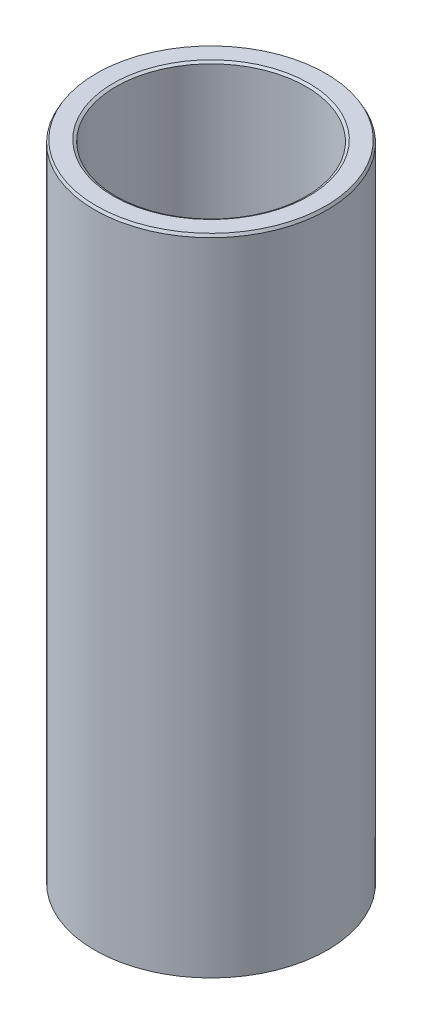
ISO-10303-21;
HEADER;
FILE_DESCRIPTION(('STEP AP214'),'2;1');
FILE_NAME('part.step','',(''),(''),'','','');
FILE_SCHEMA(('AUTOMOTIVE_DESIGN { 1 0 10303 214 1 1 1 1 }'));
ENDSEC;
DATA;
#1=APPLICATION_CONTEXT('core data for automotive mechanical design processes');
#2=APPLICATION_PROTOCOL_DEFINITION('international standard','automotive_design',2000,#1);
#3=PRODUCT_CONTEXT('',#1,'mechanical');
#4=PRODUCT('Part','Part','',(#3));
#5=PRODUCT_RELATED_PRODUCT_CATEGORY('part','',(#4));
#6=PRODUCT_DEFINITION_FORMATION('','',#4);
#7=PRODUCT_DEFINITION_CONTEXT('part definition',#1,'design');
#8=PRODUCT_DEFINITION('design','',#6,#7);
#9=PRODUCT_DEFINITION_SHAPE('','',#8);
#10=(LENGTH_UNIT() NAMED_UNIT(*) SI_UNIT(.MILLI.,.METRE.));
#11=(NAMED_UNIT(*) PLANE_ANGLE_UNIT() SI_UNIT($,.RADIAN.));
#12=(NAMED_UNIT(*) SI_UNIT($,.STERADIAN.) SOLID_ANGLE_UNIT());
#13=UNCERTAINTY_MEASURE_WITH_UNIT(LENGTH_MEASURE(1.E-05),#10,'distance_accuracy_value','');
#14=(GEOMETRIC_REPRESENTATION_CONTEXT(3) GLOBAL_UNCERTAINTY_ASSIGNED_CONTEXT((#13)) GLOBAL_UNIT_ASSIGNED_CONTEXT((#10,
#11,#12)) REPRESENTATION_CONTEXT('',''));
#15=CARTESIAN_POINT('',(0.,0.,0.));
#16=DIRECTION('',(0.,0.,1.));
#17=DIRECTION('',(1.,0.,0.));
#18=AXIS2_PLACEMENT_3D('',#15,#16,#17);
#19=CARTESIAN_POINT('',(0.,291.273279310651,0.));
#20=DIRECTION('',(0.,-1.,0.));
#21=DIRECTION('',(0.,0.,-1.));
#22=AXIS2_PLACEMENT_3D('',#19,#20,#21);
#23=CYLINDRICAL_SURFACE('',#22,52.5);
#24=CARTESIAN_POINT('',(0.,0.705340359352713,0.));
#25=DIRECTION('',(0.,1.,0.));
#26=DIRECTION('',(0.,0.,1.));
#27=AXIS2_PLACEMENT_3D('',#24,#25,#26);
#28=CIRCLE('',#27,52.5);
#29=CARTESIAN_POINT('',(0.,0.705340359352713,52.5));
#30=VERTEX_POINT('',#29);
#31=EDGE_CURVE('E10',#30,#30,#28,.T.);
#32=ORIENTED_EDGE('',*,*,#31,.T.);
#33=EDGE_LOOP('',(#32));
#34=FACE_BOUND('',#33,.T.);
#35=CARTESIAN_POINT('',(0.,290.051593971623,0.));
#36=DIRECTION('',(0.,1.,0.));
#37=DIRECTION('',(0.,0.,1.));
#38=AXIS2_PLACEMENT_3D('',#35,#36,#37);
#39=CIRCLE('',#38,52.5);
#40=CARTESIAN_POINT('',(0.,290.051593971623,52.5));
#41=VERTEX_POINT('',#40);
#42=EDGE_CURVE('E50',#41,#41,#39,.F.);
#43=ORIENTED_EDGE('',*,*,#42,.T.);
#44=EDGE_LOOP('',(#43));
#45=FACE_BOUND('',#44,.T.);
#46=ADVANCED_FACE('F39',(#34,#45),#23,.T.);
#47=CARTESIAN_POINT('',(0.,291.273279310651,0.));
#48=DIRECTION('',(0.,1.,0.));
#49=DIRECTION('',(0.,0.,1.));
#50=AXIS2_PLACEMENT_3D('',#47,#48,#49);
#51=PLANE('',#50);
#52=CARTESIAN_POINT('',(0.,291.273279310651,0.));
#53=DIRECTION('',(0.,1.,0.));
#54=DIRECTION('',(0.,0.,1.));
#55=AXIS2_PLACEMENT_3D('',#52,#53,#54);
#56=CIRCLE('',#55,44.1401051052267);
#57=CARTESIAN_POINT('',(0.,291.273279310651,44.1401051052267));
#58=VERTEX_POINT('',#57);
#59=EDGE_CURVE('E58',#58,#58,#56,.F.);
#60=ORIENTED_EDGE('',*,*,#59,.T.);
#61=EDGE_LOOP('',(#60));
#62=FACE_BOUND('',#61,.T.);
#63=CARTESIAN_POINT('',(0.,291.273279310651,0.));
#64=DIRECTION('',(0.,1.,0.));
#65=DIRECTION('',(0.,0.,1.));
#66=AXIS2_PLACEMENT_3D('',#63,#64,#65);
#67=CIRCLE('',#66,51.7946596406472);
#68=CARTESIAN_POINT('',(0.,291.273279310651,51.7946596406472));
#69=VERTEX_POINT('',#68);
#70=EDGE_CURVE('E61',#69,#69,#67,.T.);
#71=ORIENTED_EDGE('',*,*,#70,.T.);
#72=EDGE_LOOP('',(#71));
#73=FACE_BOUND('',#72,.T.);
#74=ADVANCED_FACE('F88',(#62,#73),#51,.T.);
#75=CARTESIAN_POINT('',(0.,0.,0.));
#76=DIRECTION('',(0.,1.,0.));
#77=DIRECTION('',(0.,0.,1.));
#78=AXIS2_PLACEMENT_3D('',#75,#76,#77);
#79=PLANE('',#78);
#80=CARTESIAN_POINT('',(0.,0.,0.));
#81=DIRECTION('',(0.,1.,0.));
#82=DIRECTION('',(0.,0.,1.));
#83=AXIS2_PLACEMENT_3D('',#80,#81,#82);
#84=CIRCLE('',#83,43.6237601255517);
#85=CARTESIAN_POINT('',(0.,0.,43.6237601255517));
#86=VERTEX_POINT('',#85);
#87=EDGE_CURVE('E51',#86,#86,#84,.T.);
#88=ORIENTED_EDGE('',*,*,#87,.T.);
#89=EDGE_LOOP('',(#88));
#90=FACE_BOUND('',#89,.T.);
#91=CARTESIAN_POINT('',(0.,0.,0.));
#92=DIRECTION('',(0.,1.,0.));
#93=DIRECTION('',(0.,0.,1.));
#94=AXIS2_PLACEMENT_3D('',#91,#92,#93);
#95=CIRCLE('',#94,51.2783146609722);
#96=CARTESIAN_POINT('',(0.,0.,51.2783146609722));
#97=VERTEX_POINT('',#96);
#98=EDGE_CURVE('E54',#97,#97,#95,.F.);
#99=ORIENTED_EDGE('',*,*,#98,.T.);
#100=EDGE_LOOP('',(#99));
#101=FACE_BOUND('',#100,.T.);
#102=ADVANCED_FACE('F83',(#90,#101),#79,.F.);
#103=CARTESIAN_POINT('',(0.,291.273279310651,0.));
#104=DIRECTION('',(0.,-1.,0.));
#105=DIRECTION('',(0.,0.,-1.));
#106=AXIS2_PLACEMENT_3D('',#103,#104,#105);
#107=CYLINDRICAL_SURFACE('',#106,42.918419766199);
#108=CARTESIAN_POINT('',(0.,290.567938951298,0.));
#109=DIRECTION('',(0.,1.,0.));
#110=DIRECTION('',(0.,0.,1.));
#111=AXIS2_PLACEMENT_3D('',#108,#109,#110);
#112=CIRCLE('',#111,42.918419766199);
#113=CARTESIAN_POINT('',(0.,290.567938951298,42.918419766199));
#114=VERTEX_POINT('',#113);
#115=EDGE_CURVE('E67',#114,#114,#112,.T.);
#116=ORIENTED_EDGE('',*,*,#115,.T.);
#117=EDGE_LOOP('',(#116));
#118=FACE_BOUND('',#117,.T.);
#119=CARTESIAN_POINT('',(0.,1.22168533902778,0.));
#120=DIRECTION('',(0.,1.,0.));
#121=DIRECTION('',(0.,0.,1.));
#122=AXIS2_PLACEMENT_3D('',#119,#120,#121);
#123=CIRCLE('',#122,42.918419766199);
#124=CARTESIAN_POINT('',(0.,1.22168533902778,42.918419766199));
#125=VERTEX_POINT('',#124);
#126=EDGE_CURVE('E69',#125,#125,#123,.F.);
#127=ORIENTED_EDGE('',*,*,#126,.T.);
#128=EDGE_LOOP('',(#127));
#129=FACE_BOUND('',#128,.T.);
#130=ADVANCED_FACE('F71',(#118,#129),#107,.F.);
#131=CARTESIAN_POINT('',(0.,290.567938951298,0.));
#132=DIRECTION('',(0.,1.,0.));
#133=DIRECTION('',(0.,0.,1.));
#134=AXIS2_PLACEMENT_3D('',#131,#132,#133);
#135=CONICAL_SURFACE('',#134,42.918419766199,1.04719755119658);
#136=ORIENTED_EDGE('',*,*,#59,.F.);
#137=EDGE_LOOP('',(#136));
#138=FACE_BOUND('',#137,.T.);
#139=ORIENTED_EDGE('',*,*,#115,.F.);
#140=EDGE_LOOP('',(#139));
#141=FACE_BOUND('',#140,.T.);
#142=ADVANCED_FACE('F77',(#138,#141),#135,.F.);
#143=CARTESIAN_POINT('',(0.,0.,0.));
#144=DIRECTION('',(0.,-1.,0.));
#145=DIRECTION('',(0.,0.,-1.));
#146=AXIS2_PLACEMENT_3D('',#143,#144,#145);
#147=CONICAL_SURFACE('',#146,43.6237601255517,0.523598775598311);
#148=ORIENTED_EDGE('',*,*,#126,.F.);
#149=EDGE_LOOP('',(#148));
#150=FACE_BOUND('',#149,.T.);
#151=ORIENTED_EDGE('',*,*,#87,.F.);
#152=EDGE_LOOP('',(#151));
#153=FACE_BOUND('',#152,.T.);
#154=ADVANCED_FACE('F73',(#150,#153),#147,.F.);
#155=CARTESIAN_POINT('',(0.,0.705340359352713,0.));
#156=DIRECTION('',(0.,1.,0.));
#157=DIRECTION('',(0.,0.,1.));
#158=AXIS2_PLACEMENT_3D('',#155,#156,#157);
#159=CONICAL_SURFACE('',#158,52.5,1.0471975511966);
#160=ORIENTED_EDGE('',*,*,#98,.F.);
#161=EDGE_LOOP('',(#160));
#162=FACE_BOUND('',#161,.T.);
#163=ORIENTED_EDGE('',*,*,#31,.F.);
#164=EDGE_LOOP('',(#163));
#165=FACE_BOUND('',#164,.T.);
#166=ADVANCED_FACE('F76',(#162,#165),#159,.T.);
#167=CARTESIAN_POINT('',(0.,291.273279310651,0.));
#168=DIRECTION('',(0.,-1.,0.));
#169=DIRECTION('',(0.,0.,-1.));
#170=AXIS2_PLACEMENT_3D('',#167,#168,#169);
#171=CONICAL_SURFACE('',#170,51.7946596406472,0.523598775598301);
#172=ORIENTED_EDGE('',*,*,#42,.F.);
#173=EDGE_LOOP('',(#172));
#174=FACE_BOUND('',#173,.T.);
#175=ORIENTED_EDGE('',*,*,#70,.F.);
#176=EDGE_LOOP('',(#175));
#177=FACE_BOUND('',#176,.T.);
#178=ADVANCED_FACE('F45',(#174,#177),#171,.T.);
#179=CLOSED_SHELL('',(#46,#74,#102,#130,#142,#154,#166,#178));
#180=MANIFOLD_SOLID_BREP('B2',#179);
#181=ADVANCED_BREP_SHAPE_REPRESENTATION('',(#18,#180),#14);
#182=SHAPE_DEFINITION_REPRESENTATION(#9,#181);
ENDSEC;
END-ISO-10303-21;
